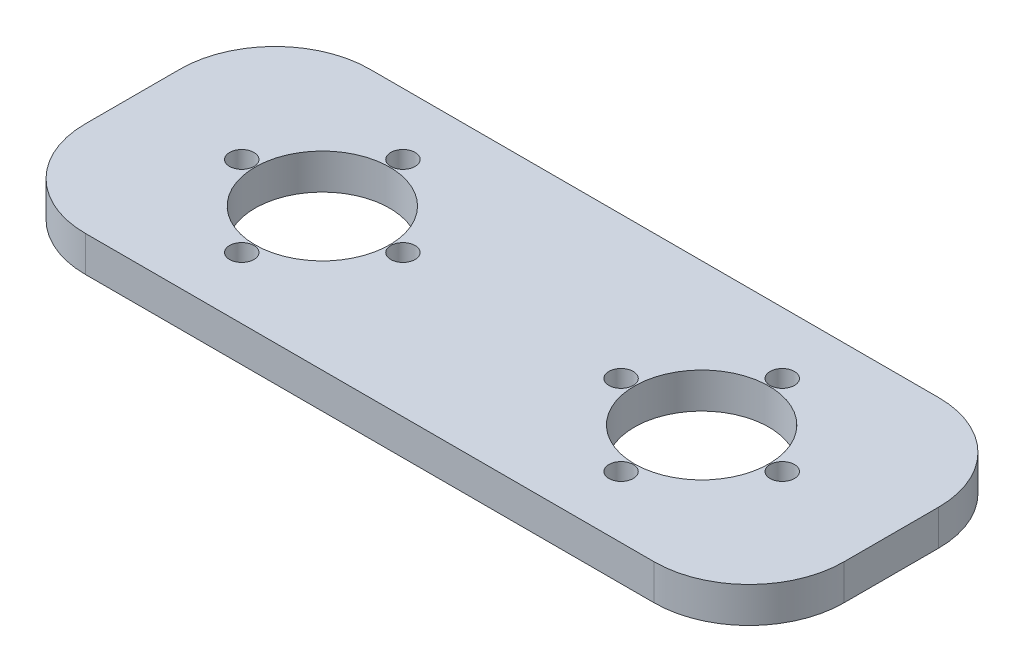
ISO-10303-21;
HEADER;
FILE_DESCRIPTION(('STEP AP214'),'2;1');
FILE_NAME('part.step','',(''),(''),'','','');
FILE_SCHEMA(('AUTOMOTIVE_DESIGN { 1 0 10303 214 1 1 1 1 }'));
ENDSEC;
DATA;
#1=APPLICATION_CONTEXT('core data for automotive mechanical design processes');
#2=APPLICATION_PROTOCOL_DEFINITION('international standard','automotive_design',2000,#1);
#3=PRODUCT_CONTEXT('',#1,'mechanical');
#4=PRODUCT('Part','Part','',(#3));
#5=PRODUCT_RELATED_PRODUCT_CATEGORY('part','',(#4));
#6=PRODUCT_DEFINITION_FORMATION('','',#4);
#7=PRODUCT_DEFINITION_CONTEXT('part definition',#1,'design');
#8=PRODUCT_DEFINITION('design','',#6,#7);
#9=PRODUCT_DEFINITION_SHAPE('','',#8);
#10=(LENGTH_UNIT() NAMED_UNIT(*) SI_UNIT(.MILLI.,.METRE.));
#11=(NAMED_UNIT(*) PLANE_ANGLE_UNIT() SI_UNIT($,.RADIAN.));
#12=(NAMED_UNIT(*) SI_UNIT($,.STERADIAN.) SOLID_ANGLE_UNIT());
#13=UNCERTAINTY_MEASURE_WITH_UNIT(LENGTH_MEASURE(1.E-05),#10,'distance_accuracy_value','');
#14=(GEOMETRIC_REPRESENTATION_CONTEXT(3) GLOBAL_UNCERTAINTY_ASSIGNED_CONTEXT((#13)) GLOBAL_UNIT_ASSIGNED_CONTEXT((#10,
#11,#12)) REPRESENTATION_CONTEXT('',''));
#15=CARTESIAN_POINT('',(0.,0.,0.));
#16=DIRECTION('',(0.,0.,1.));
#17=DIRECTION('',(1.,0.,0.));
#18=AXIS2_PLACEMENT_3D('',#15,#16,#17);
#19=CARTESIAN_POINT('',(0.,4.7625,-38.1));
#20=DIRECTION('',(0.,-1.,0.));
#21=DIRECTION('',(0.,0.,-1.));
#22=AXIS2_PLACEMENT_3D('',#19,#20,#21);
#23=PLANE('',#22);
#24=CARTESIAN_POINT('',(25.4,4.7625,-29.845));
#25=DIRECTION('',(0.,1.,0.));
#26=DIRECTION('',(0.,0.,1.));
#27=AXIS2_PLACEMENT_3D('',#24,#25,#26);
#28=CIRCLE('',#27,1.63194999999999);
#29=CARTESIAN_POINT('',(25.4,4.7625,-28.21305));
#30=VERTEX_POINT('',#29);
#31=EDGE_CURVE('E166',#30,#30,#28,.T.);
#32=ORIENTED_EDGE('',*,*,#31,.F.);
#33=EDGE_LOOP('',(#32));
#34=FACE_BOUND('',#33,.T.);
#35=CARTESIAN_POINT('',(36.195,4.7625,-19.05));
#36=DIRECTION('',(0.,1.,0.));
#37=DIRECTION('',(0.,0.,1.));
#38=AXIS2_PLACEMENT_3D('',#35,#36,#37);
#39=CIRCLE('',#38,1.63194999999999);
#40=CARTESIAN_POINT('',(36.195,4.7625,-17.41805));
#41=VERTEX_POINT('',#40);
#42=EDGE_CURVE('E162',#41,#41,#39,.T.);
#43=ORIENTED_EDGE('',*,*,#42,.F.);
#44=EDGE_LOOP('',(#43));
#45=FACE_BOUND('',#44,.T.);
#46=CARTESIAN_POINT('',(25.4,4.7625,-8.255));
#47=DIRECTION('',(0.,1.,0.));
#48=DIRECTION('',(0.,0.,1.));
#49=AXIS2_PLACEMENT_3D('',#46,#47,#48);
#50=CIRCLE('',#49,1.63194999999999);
#51=CARTESIAN_POINT('',(25.4,4.7625,-6.62305000000001));
#52=VERTEX_POINT('',#51);
#53=EDGE_CURVE('E158',#52,#52,#50,.T.);
#54=ORIENTED_EDGE('',*,*,#53,.F.);
#55=EDGE_LOOP('',(#54));
#56=FACE_BOUND('',#55,.T.);
#57=CARTESIAN_POINT('',(14.605,4.7625,-19.05));
#58=DIRECTION('',(0.,1.,0.));
#59=DIRECTION('',(0.,0.,1.));
#60=AXIS2_PLACEMENT_3D('',#57,#58,#59);
#61=CIRCLE('',#60,1.63194999999999);
#62=CARTESIAN_POINT('',(14.605,4.7625,-17.41805));
#63=VERTEX_POINT('',#62);
#64=EDGE_CURVE('E154',#63,#63,#61,.T.);
#65=ORIENTED_EDGE('',*,*,#64,.F.);
#66=EDGE_LOOP('',(#65));
#67=FACE_BOUND('',#66,.T.);
#68=CARTESIAN_POINT('',(65.405,4.7625,-19.05));
#69=DIRECTION('',(0.,1.,0.));
#70=DIRECTION('',(0.,0.,1.));
#71=AXIS2_PLACEMENT_3D('',#68,#69,#70);
#72=CIRCLE('',#71,1.63194999999999);
#73=CARTESIAN_POINT('',(65.405,4.7625,-17.41805));
#74=VERTEX_POINT('',#73);
#75=EDGE_CURVE('E150',#74,#74,#72,.T.);
#76=ORIENTED_EDGE('',*,*,#75,.F.);
#77=EDGE_LOOP('',(#76));
#78=FACE_BOUND('',#77,.T.);
#79=CARTESIAN_POINT('',(76.2,4.7625,-29.845));
#80=DIRECTION('',(0.,1.,0.));
#81=DIRECTION('',(0.,0.,1.));
#82=AXIS2_PLACEMENT_3D('',#79,#80,#81);
#83=CIRCLE('',#82,1.63194999999999);
#84=CARTESIAN_POINT('',(76.2,4.7625,-28.21305));
#85=VERTEX_POINT('',#84);
#86=EDGE_CURVE('E146',#85,#85,#83,.T.);
#87=ORIENTED_EDGE('',*,*,#86,.F.);
#88=EDGE_LOOP('',(#87));
#89=FACE_BOUND('',#88,.T.);
#90=CARTESIAN_POINT('',(86.995,4.7625,-19.05));
#91=DIRECTION('',(0.,1.,0.));
#92=DIRECTION('',(0.,0.,1.));
#93=AXIS2_PLACEMENT_3D('',#90,#91,#92);
#94=CIRCLE('',#93,1.63194999999999);
#95=CARTESIAN_POINT('',(86.995,4.7625,-17.41805));
#96=VERTEX_POINT('',#95);
#97=EDGE_CURVE('E142',#96,#96,#94,.T.);
#98=ORIENTED_EDGE('',*,*,#97,.F.);
#99=EDGE_LOOP('',(#98));
#100=FACE_BOUND('',#99,.T.);
#101=CARTESIAN_POINT('',(76.2,4.7625,-8.255));
#102=DIRECTION('',(0.,1.,0.));
#103=DIRECTION('',(0.,0.,1.));
#104=AXIS2_PLACEMENT_3D('',#101,#102,#103);
#105=CIRCLE('',#104,1.63194999999999);
#106=CARTESIAN_POINT('',(76.2,4.7625,-6.62305000000001));
#107=VERTEX_POINT('',#106);
#108=EDGE_CURVE('E138',#107,#107,#105,.T.);
#109=ORIENTED_EDGE('',*,*,#108,.F.);
#110=EDGE_LOOP('',(#109));
#111=FACE_BOUND('',#110,.T.);
#112=CARTESIAN_POINT('',(25.4,4.7625,-19.05));
#113=DIRECTION('',(0.,1.,0.));
#114=DIRECTION('',(0.,0.,1.));
#115=AXIS2_PLACEMENT_3D('',#112,#113,#114);
#116=CIRCLE('',#115,9.017);
#117=CARTESIAN_POINT('',(25.4,4.7625,-10.033));
#118=VERTEX_POINT('',#117);
#119=EDGE_CURVE('E196',#118,#118,#116,.T.);
#120=ORIENTED_EDGE('',*,*,#119,.F.);
#121=EDGE_LOOP('',(#120));
#122=FACE_BOUND('',#121,.T.);
#123=DIRECTION('',(0.,0.,-1.));
#124=VECTOR('',#123,1.);
#125=CARTESIAN_POINT('',(101.6,4.7625,0.));
#126=LINE('',#125,#124);
#127=CARTESIAN_POINT('',(101.6,4.7625,-12.7));
#128=VERTEX_POINT('',#127);
#129=CARTESIAN_POINT('',(101.6,4.7625,-25.4));
#130=VERTEX_POINT('',#129);
#131=EDGE_CURVE('E203',#128,#130,#126,.T.);
#132=ORIENTED_EDGE('',*,*,#131,.T.);
#133=CARTESIAN_POINT('',(88.9,4.7625,-25.4));
#134=DIRECTION('',(0.,-1.,0.));
#135=DIRECTION('',(0.,0.,-1.));
#136=AXIS2_PLACEMENT_3D('',#133,#134,#135);
#137=CIRCLE('',#136,12.7);
#138=CARTESIAN_POINT('',(88.9,4.7625,-38.1));
#139=VERTEX_POINT('',#138);
#140=EDGE_CURVE('E180',#130,#139,#137,.F.);
#141=ORIENTED_EDGE('',*,*,#140,.T.);
#142=DIRECTION('',(-1.,0.,0.));
#143=VECTOR('',#142,1.);
#144=CARTESIAN_POINT('',(0.,4.7625,-38.1));
#145=LINE('',#144,#143);
#146=CARTESIAN_POINT('',(12.7,4.7625,-38.1));
#147=VERTEX_POINT('',#146);
#148=EDGE_CURVE('E118',#139,#147,#145,.T.);
#149=ORIENTED_EDGE('',*,*,#148,.T.);
#150=CARTESIAN_POINT('',(12.7,4.7625,-25.4));
#151=DIRECTION('',(0.,-1.,0.));
#152=DIRECTION('',(0.,0.,-1.));
#153=AXIS2_PLACEMENT_3D('',#150,#151,#152);
#154=CIRCLE('',#153,12.7);
#155=CARTESIAN_POINT('',(0.,4.7625,-25.4));
#156=VERTEX_POINT('',#155);
#157=EDGE_CURVE('E175',#147,#156,#154,.F.);
#158=ORIENTED_EDGE('',*,*,#157,.T.);
#159=DIRECTION('',(0.,0.,1.));
#160=VECTOR('',#159,1.);
#161=CARTESIAN_POINT('',(0.,4.7625,0.));
#162=LINE('',#161,#160);
#163=CARTESIAN_POINT('',(0.,4.7625,-12.7));
#164=VERTEX_POINT('',#163);
#165=EDGE_CURVE('E125',#156,#164,#162,.T.);
#166=ORIENTED_EDGE('',*,*,#165,.T.);
#167=CARTESIAN_POINT('',(12.7,4.7625,-12.7));
#168=DIRECTION('',(0.,-1.,0.));
#169=DIRECTION('',(0.,0.,-1.));
#170=AXIS2_PLACEMENT_3D('',#167,#168,#169);
#171=CIRCLE('',#170,12.7);
#172=CARTESIAN_POINT('',(12.7,4.7625,0.));
#173=VERTEX_POINT('',#172);
#174=EDGE_CURVE('E54',#164,#173,#171,.F.);
#175=ORIENTED_EDGE('',*,*,#174,.T.);
#176=DIRECTION('',(1.,0.,0.));
#177=VECTOR('',#176,1.);
#178=CARTESIAN_POINT('',(0.,4.7625,0.));
#179=LINE('',#178,#177);
#180=CARTESIAN_POINT('',(88.9,4.7625,0.));
#181=VERTEX_POINT('',#180);
#182=EDGE_CURVE('E128',#173,#181,#179,.T.);
#183=ORIENTED_EDGE('',*,*,#182,.T.);
#184=CARTESIAN_POINT('',(88.9,4.7625,-12.7));
#185=DIRECTION('',(0.,-1.,0.));
#186=DIRECTION('',(0.,0.,-1.));
#187=AXIS2_PLACEMENT_3D('',#184,#185,#186);
#188=CIRCLE('',#187,12.7);
#189=EDGE_CURVE('E178',#181,#128,#188,.F.);
#190=ORIENTED_EDGE('',*,*,#189,.T.);
#191=EDGE_LOOP('',(#132,#141,#149,#158,#166,#175,#183,#190));
#192=FACE_BOUND('',#191,.T.);
#193=CARTESIAN_POINT('',(76.2,4.7625,-19.05));
#194=DIRECTION('',(0.,1.,0.));
#195=DIRECTION('',(0.,0.,1.));
#196=AXIS2_PLACEMENT_3D('',#193,#194,#195);
#197=CIRCLE('',#196,9.01699999999999);
#198=CARTESIAN_POINT('',(76.2,4.7625,-10.033));
#199=VERTEX_POINT('',#198);
#200=EDGE_CURVE('E208',#199,#199,#197,.T.);
#201=ORIENTED_EDGE('',*,*,#200,.F.);
#202=EDGE_LOOP('',(#201));
#203=FACE_BOUND('',#202,.T.);
#204=ADVANCED_FACE('F32',(#34,#45,#56,#67,#78,#89,#100,#111,#122,#192,#203),#23,.F.);
#205=CARTESIAN_POINT('',(0.,0.,-38.1));
#206=DIRECTION('',(0.,-1.,0.));
#207=DIRECTION('',(0.,0.,-1.));
#208=AXIS2_PLACEMENT_3D('',#205,#206,#207);
#209=PLANE('',#208);
#210=CARTESIAN_POINT('',(25.4,0.,-29.845));
#211=DIRECTION('',(0.,-1.,0.));
#212=DIRECTION('',(0.,0.,-1.));
#213=AXIS2_PLACEMENT_3D('',#210,#211,#212);
#214=CIRCLE('',#213,1.63194999999999);
#215=CARTESIAN_POINT('',(25.4,0.,-31.47695));
#216=VERTEX_POINT('',#215);
#217=EDGE_CURVE('E163',#216,#216,#214,.T.);
#218=ORIENTED_EDGE('',*,*,#217,.F.);
#219=EDGE_LOOP('',(#218));
#220=FACE_BOUND('',#219,.T.);
#221=CARTESIAN_POINT('',(36.195,0.,-19.05));
#222=DIRECTION('',(0.,-1.,0.));
#223=DIRECTION('',(0.,0.,-1.));
#224=AXIS2_PLACEMENT_3D('',#221,#222,#223);
#225=CIRCLE('',#224,1.63194999999999);
#226=CARTESIAN_POINT('',(36.195,0.,-20.68195));
#227=VERTEX_POINT('',#226);
#228=EDGE_CURVE('E159',#227,#227,#225,.T.);
#229=ORIENTED_EDGE('',*,*,#228,.F.);
#230=EDGE_LOOP('',(#229));
#231=FACE_BOUND('',#230,.T.);
#232=CARTESIAN_POINT('',(25.4,0.,-8.255));
#233=DIRECTION('',(0.,-1.,0.));
#234=DIRECTION('',(0.,0.,-1.));
#235=AXIS2_PLACEMENT_3D('',#232,#233,#234);
#236=CIRCLE('',#235,1.63194999999999);
#237=CARTESIAN_POINT('',(25.4,0.,-9.88694999999999));
#238=VERTEX_POINT('',#237);
#239=EDGE_CURVE('E155',#238,#238,#236,.T.);
#240=ORIENTED_EDGE('',*,*,#239,.F.);
#241=EDGE_LOOP('',(#240));
#242=FACE_BOUND('',#241,.T.);
#243=CARTESIAN_POINT('',(14.605,0.,-19.05));
#244=DIRECTION('',(0.,-1.,0.));
#245=DIRECTION('',(0.,0.,-1.));
#246=AXIS2_PLACEMENT_3D('',#243,#244,#245);
#247=CIRCLE('',#246,1.63194999999999);
#248=CARTESIAN_POINT('',(14.605,0.,-20.68195));
#249=VERTEX_POINT('',#248);
#250=EDGE_CURVE('E151',#249,#249,#247,.T.);
#251=ORIENTED_EDGE('',*,*,#250,.F.);
#252=EDGE_LOOP('',(#251));
#253=FACE_BOUND('',#252,.T.);
#254=CARTESIAN_POINT('',(65.405,0.,-19.05));
#255=DIRECTION('',(0.,-1.,0.));
#256=DIRECTION('',(0.,0.,-1.));
#257=AXIS2_PLACEMENT_3D('',#254,#255,#256);
#258=CIRCLE('',#257,1.63194999999999);
#259=CARTESIAN_POINT('',(65.405,0.,-20.68195));
#260=VERTEX_POINT('',#259);
#261=EDGE_CURVE('E147',#260,#260,#258,.T.);
#262=ORIENTED_EDGE('',*,*,#261,.F.);
#263=EDGE_LOOP('',(#262));
#264=FACE_BOUND('',#263,.T.);
#265=CARTESIAN_POINT('',(76.2,0.,-29.845));
#266=DIRECTION('',(0.,-1.,0.));
#267=DIRECTION('',(0.,0.,-1.));
#268=AXIS2_PLACEMENT_3D('',#265,#266,#267);
#269=CIRCLE('',#268,1.63194999999999);
#270=CARTESIAN_POINT('',(76.2,0.,-31.47695));
#271=VERTEX_POINT('',#270);
#272=EDGE_CURVE('E143',#271,#271,#269,.T.);
#273=ORIENTED_EDGE('',*,*,#272,.F.);
#274=EDGE_LOOP('',(#273));
#275=FACE_BOUND('',#274,.T.);
#276=CARTESIAN_POINT('',(86.995,0.,-19.05));
#277=DIRECTION('',(0.,-1.,0.));
#278=DIRECTION('',(0.,0.,-1.));
#279=AXIS2_PLACEMENT_3D('',#276,#277,#278);
#280=CIRCLE('',#279,1.63194999999999);
#281=CARTESIAN_POINT('',(86.995,0.,-20.68195));
#282=VERTEX_POINT('',#281);
#283=EDGE_CURVE('E139',#282,#282,#280,.T.);
#284=ORIENTED_EDGE('',*,*,#283,.F.);
#285=EDGE_LOOP('',(#284));
#286=FACE_BOUND('',#285,.T.);
#287=CARTESIAN_POINT('',(76.2,0.,-8.255));
#288=DIRECTION('',(0.,-1.,0.));
#289=DIRECTION('',(0.,0.,-1.));
#290=AXIS2_PLACEMENT_3D('',#287,#288,#289);
#291=CIRCLE('',#290,1.63194999999999);
#292=CARTESIAN_POINT('',(76.2,0.,-9.88695));
#293=VERTEX_POINT('',#292);
#294=EDGE_CURVE('E134',#293,#293,#291,.T.);
#295=ORIENTED_EDGE('',*,*,#294,.F.);
#296=EDGE_LOOP('',(#295));
#297=FACE_BOUND('',#296,.T.);
#298=CARTESIAN_POINT('',(25.4,0.,-19.05));
#299=DIRECTION('',(0.,1.,0.));
#300=DIRECTION('',(0.,0.,1.));
#301=AXIS2_PLACEMENT_3D('',#298,#299,#300);
#302=CIRCLE('',#301,9.017);
#303=CARTESIAN_POINT('',(25.4,0.,-10.033));
#304=VERTEX_POINT('',#303);
#305=EDGE_CURVE('E199',#304,#304,#302,.T.);
#306=ORIENTED_EDGE('',*,*,#305,.T.);
#307=EDGE_LOOP('',(#306));
#308=FACE_BOUND('',#307,.T.);
#309=DIRECTION('',(-1.,0.,0.));
#310=VECTOR('',#309,1.);
#311=CARTESIAN_POINT('',(0.,0.,-38.1));
#312=LINE('',#311,#310);
#313=CARTESIAN_POINT('',(88.9,0.,-38.1));
#314=VERTEX_POINT('',#313);
#315=CARTESIAN_POINT('',(12.7,0.,-38.1));
#316=VERTEX_POINT('',#315);
#317=EDGE_CURVE('E115',#314,#316,#312,.T.);
#318=ORIENTED_EDGE('',*,*,#317,.F.);
#319=CARTESIAN_POINT('',(88.9,0.,-25.4));
#320=DIRECTION('',(0.,-1.,0.));
#321=DIRECTION('',(0.,0.,-1.));
#322=AXIS2_PLACEMENT_3D('',#319,#320,#321);
#323=CIRCLE('',#322,12.7);
#324=CARTESIAN_POINT('',(101.6,0.,-25.4));
#325=VERTEX_POINT('',#324);
#326=EDGE_CURVE('E98',#314,#325,#323,.T.);
#327=ORIENTED_EDGE('',*,*,#326,.T.);
#328=DIRECTION('',(0.,0.,-1.));
#329=VECTOR('',#328,1.);
#330=CARTESIAN_POINT('',(101.6,0.,0.));
#331=LINE('',#330,#329);
#332=CARTESIAN_POINT('',(101.6,0.,-12.7));
#333=VERTEX_POINT('',#332);
#334=EDGE_CURVE('E126',#333,#325,#331,.T.);
#335=ORIENTED_EDGE('',*,*,#334,.F.);
#336=CARTESIAN_POINT('',(88.9,0.,-12.7));
#337=DIRECTION('',(0.,-1.,0.));
#338=DIRECTION('',(0.,0.,-1.));
#339=AXIS2_PLACEMENT_3D('',#336,#337,#338);
#340=CIRCLE('',#339,12.7);
#341=CARTESIAN_POINT('',(88.9,0.,0.));
#342=VERTEX_POINT('',#341);
#343=EDGE_CURVE('E109',#333,#342,#340,.T.);
#344=ORIENTED_EDGE('',*,*,#343,.T.);
#345=DIRECTION('',(1.,0.,0.));
#346=VECTOR('',#345,1.);
#347=CARTESIAN_POINT('',(0.,0.,0.));
#348=LINE('',#347,#346);
#349=CARTESIAN_POINT('',(12.7,0.,0.));
#350=VERTEX_POINT('',#349);
#351=EDGE_CURVE('E130',#350,#342,#348,.T.);
#352=ORIENTED_EDGE('',*,*,#351,.F.);
#353=CARTESIAN_POINT('',(12.7,0.,-12.7));
#354=DIRECTION('',(0.,-1.,0.));
#355=DIRECTION('',(0.,0.,-1.));
#356=AXIS2_PLACEMENT_3D('',#353,#354,#355);
#357=CIRCLE('',#356,12.7);
#358=CARTESIAN_POINT('',(0.,0.,-12.7));
#359=VERTEX_POINT('',#358);
#360=EDGE_CURVE('E169',#350,#359,#357,.T.);
#361=ORIENTED_EDGE('',*,*,#360,.T.);
#362=DIRECTION('',(0.,0.,1.));
#363=VECTOR('',#362,1.);
#364=CARTESIAN_POINT('',(0.,0.,0.));
#365=LINE('',#364,#363);
#366=CARTESIAN_POINT('',(0.,0.,-25.4));
#367=VERTEX_POINT('',#366);
#368=EDGE_CURVE('E191',#367,#359,#365,.T.);
#369=ORIENTED_EDGE('',*,*,#368,.F.);
#370=CARTESIAN_POINT('',(12.7,0.,-25.4));
#371=DIRECTION('',(0.,-1.,0.));
#372=DIRECTION('',(0.,0.,-1.));
#373=AXIS2_PLACEMENT_3D('',#370,#371,#372);
#374=CIRCLE('',#373,12.7);
#375=EDGE_CURVE('E119',#367,#316,#374,.T.);
#376=ORIENTED_EDGE('',*,*,#375,.T.);
#377=EDGE_LOOP('',(#318,#327,#335,#344,#352,#361,#369,#376));
#378=FACE_BOUND('',#377,.T.);
#379=CARTESIAN_POINT('',(76.2,0.,-19.05));
#380=DIRECTION('',(0.,1.,0.));
#381=DIRECTION('',(0.,0.,1.));
#382=AXIS2_PLACEMENT_3D('',#379,#380,#381);
#383=CIRCLE('',#382,9.01699999999999);
#384=CARTESIAN_POINT('',(76.2,0.,-10.033));
#385=VERTEX_POINT('',#384);
#386=EDGE_CURVE('E137',#385,#385,#383,.T.);
#387=ORIENTED_EDGE('',*,*,#386,.T.);
#388=EDGE_LOOP('',(#387));
#389=FACE_BOUND('',#388,.T.);
#390=ADVANCED_FACE('F122',(#220,#231,#242,#253,#264,#275,#286,#297,#308,#378,#389),#209,.T.);
#391=CARTESIAN_POINT('',(0.,4.7625,0.));
#392=DIRECTION('',(1.,0.,0.));
#393=DIRECTION('',(0.,0.,-1.));
#394=AXIS2_PLACEMENT_3D('',#391,#392,#393);
#395=PLANE('',#394);
#396=ORIENTED_EDGE('',*,*,#368,.T.);
#397=DIRECTION('',(0.,-1.,0.));
#398=VECTOR('',#397,1.);
#399=CARTESIAN_POINT('',(0.,4.7625,-12.7));
#400=LINE('',#399,#398);
#401=EDGE_CURVE('E11',#359,#164,#400,.F.);
#402=ORIENTED_EDGE('',*,*,#401,.T.);
#403=ORIENTED_EDGE('',*,*,#165,.F.);
#404=DIRECTION('',(0.,-1.,0.));
#405=VECTOR('',#404,1.);
#406=CARTESIAN_POINT('',(0.,4.7625,-25.4));
#407=LINE('',#406,#405);
#408=EDGE_CURVE('E40',#156,#367,#407,.T.);
#409=ORIENTED_EDGE('',*,*,#408,.T.);
#410=EDGE_LOOP('',(#396,#402,#403,#409));
#411=FACE_BOUND('',#410,.T.);
#412=ADVANCED_FACE('F190',(#411),#395,.F.);
#413=CARTESIAN_POINT('',(0.,4.7625,0.));
#414=DIRECTION('',(0.,0.,-1.));
#415=DIRECTION('',(-1.,0.,0.));
#416=AXIS2_PLACEMENT_3D('',#413,#414,#415);
#417=PLANE('',#416);
#418=ORIENTED_EDGE('',*,*,#351,.T.);
#419=DIRECTION('',(0.,-1.,0.));
#420=VECTOR('',#419,1.);
#421=CARTESIAN_POINT('',(88.9,4.7625,0.));
#422=LINE('',#421,#420);
#423=EDGE_CURVE('E47',#342,#181,#422,.F.);
#424=ORIENTED_EDGE('',*,*,#423,.T.);
#425=ORIENTED_EDGE('',*,*,#182,.F.);
#426=DIRECTION('',(0.,-1.,0.));
#427=VECTOR('',#426,1.);
#428=CARTESIAN_POINT('',(12.7,4.7625,0.));
#429=LINE('',#428,#427);
#430=EDGE_CURVE('E182',#173,#350,#429,.T.);
#431=ORIENTED_EDGE('',*,*,#430,.T.);
#432=EDGE_LOOP('',(#418,#424,#425,#431));
#433=FACE_BOUND('',#432,.T.);
#434=ADVANCED_FACE('F268',(#433),#417,.F.);
#435=CARTESIAN_POINT('',(101.6,4.7625,0.));
#436=DIRECTION('',(-1.,0.,0.));
#437=DIRECTION('',(0.,0.,1.));
#438=AXIS2_PLACEMENT_3D('',#435,#436,#437);
#439=PLANE('',#438);
#440=ORIENTED_EDGE('',*,*,#334,.T.);
#441=DIRECTION('',(0.,-1.,0.));
#442=VECTOR('',#441,1.);
#443=CARTESIAN_POINT('',(101.6,4.7625,-25.4));
#444=LINE('',#443,#442);
#445=EDGE_CURVE('E103',#325,#130,#444,.F.);
#446=ORIENTED_EDGE('',*,*,#445,.T.);
#447=ORIENTED_EDGE('',*,*,#131,.F.);
#448=DIRECTION('',(0.,-1.,0.));
#449=VECTOR('',#448,1.);
#450=CARTESIAN_POINT('',(101.6,4.7625,-12.7));
#451=LINE('',#450,#449);
#452=EDGE_CURVE('E108',#128,#333,#451,.T.);
#453=ORIENTED_EDGE('',*,*,#452,.T.);
#454=EDGE_LOOP('',(#440,#446,#447,#453));
#455=FACE_BOUND('',#454,.T.);
#456=ADVANCED_FACE('F276',(#455),#439,.F.);
#457=CARTESIAN_POINT('',(0.,4.7625,-38.1));
#458=DIRECTION('',(0.,0.,1.));
#459=DIRECTION('',(1.,0.,0.));
#460=AXIS2_PLACEMENT_3D('',#457,#458,#459);
#461=PLANE('',#460);
#462=ORIENTED_EDGE('',*,*,#148,.F.);
#463=DIRECTION('',(0.,-1.,0.));
#464=VECTOR('',#463,1.);
#465=CARTESIAN_POINT('',(88.9,4.7625,-38.1));
#466=LINE('',#465,#464);
#467=EDGE_CURVE('E102',#139,#314,#466,.T.);
#468=ORIENTED_EDGE('',*,*,#467,.T.);
#469=ORIENTED_EDGE('',*,*,#317,.T.);
#470=DIRECTION('',(0.,-1.,0.));
#471=VECTOR('',#470,1.);
#472=CARTESIAN_POINT('',(12.7,4.7625,-38.1));
#473=LINE('',#472,#471);
#474=EDGE_CURVE('E120',#316,#147,#473,.F.);
#475=ORIENTED_EDGE('',*,*,#474,.T.);
#476=EDGE_LOOP('',(#462,#468,#469,#475));
#477=FACE_BOUND('',#476,.T.);
#478=ADVANCED_FACE('F114',(#477),#461,.F.);
#479=CARTESIAN_POINT('',(25.4,4.7625,-19.05));
#480=DIRECTION('',(0.,-1.,0.));
#481=DIRECTION('',(0.,0.,-1.));
#482=AXIS2_PLACEMENT_3D('',#479,#480,#481);
#483=CYLINDRICAL_SURFACE('',#482,9.017);
#484=ORIENTED_EDGE('',*,*,#119,.T.);
#485=EDGE_LOOP('',(#484));
#486=FACE_BOUND('',#485,.T.);
#487=ORIENTED_EDGE('',*,*,#305,.F.);
#488=EDGE_LOOP('',(#487));
#489=FACE_BOUND('',#488,.T.);
#490=ADVANCED_FACE('F259',(#486,#489),#483,.F.);
#491=CARTESIAN_POINT('',(76.2,4.7625,-19.05));
#492=DIRECTION('',(0.,-1.,0.));
#493=DIRECTION('',(0.,0.,-1.));
#494=AXIS2_PLACEMENT_3D('',#491,#492,#493);
#495=CYLINDRICAL_SURFACE('',#494,9.01699999999999);
#496=ORIENTED_EDGE('',*,*,#200,.T.);
#497=EDGE_LOOP('',(#496));
#498=FACE_BOUND('',#497,.T.);
#499=ORIENTED_EDGE('',*,*,#386,.F.);
#500=EDGE_LOOP('',(#499));
#501=FACE_BOUND('',#500,.T.);
#502=ADVANCED_FACE('F255',(#498,#501),#495,.F.);
#503=CARTESIAN_POINT('',(76.2,4.7625,-8.255));
#504=DIRECTION('',(0.,1.,0.));
#505=DIRECTION('',(0.,0.,1.));
#506=AXIS2_PLACEMENT_3D('',#503,#504,#505);
#507=CYLINDRICAL_SURFACE('',#506,1.63194999999999);
#508=ORIENTED_EDGE('',*,*,#294,.T.);
#509=EDGE_LOOP('',(#508));
#510=FACE_BOUND('',#509,.T.);
#511=ORIENTED_EDGE('',*,*,#108,.T.);
#512=EDGE_LOOP('',(#511));
#513=FACE_BOUND('',#512,.T.);
#514=ADVANCED_FACE('F258',(#510,#513),#507,.F.);
#515=CARTESIAN_POINT('',(86.995,4.7625,-19.05));
#516=DIRECTION('',(0.,1.,0.));
#517=DIRECTION('',(0.,0.,1.));
#518=AXIS2_PLACEMENT_3D('',#515,#516,#517);
#519=CYLINDRICAL_SURFACE('',#518,1.63194999999999);
#520=ORIENTED_EDGE('',*,*,#283,.T.);
#521=EDGE_LOOP('',(#520));
#522=FACE_BOUND('',#521,.T.);
#523=ORIENTED_EDGE('',*,*,#97,.T.);
#524=EDGE_LOOP('',(#523));
#525=FACE_BOUND('',#524,.T.);
#526=ADVANCED_FACE('F409',(#522,#525),#519,.F.);
#527=CARTESIAN_POINT('',(76.2,4.7625,-29.845));
#528=DIRECTION('',(0.,1.,0.));
#529=DIRECTION('',(0.,0.,1.));
#530=AXIS2_PLACEMENT_3D('',#527,#528,#529);
#531=CYLINDRICAL_SURFACE('',#530,1.63194999999999);
#532=ORIENTED_EDGE('',*,*,#272,.T.);
#533=EDGE_LOOP('',(#532));
#534=FACE_BOUND('',#533,.T.);
#535=ORIENTED_EDGE('',*,*,#86,.T.);
#536=EDGE_LOOP('',(#535));
#537=FACE_BOUND('',#536,.T.);
#538=ADVANCED_FACE('F399',(#534,#537),#531,.F.);
#539=CARTESIAN_POINT('',(65.405,4.7625,-19.05));
#540=DIRECTION('',(0.,1.,0.));
#541=DIRECTION('',(0.,0.,1.));
#542=AXIS2_PLACEMENT_3D('',#539,#540,#541);
#543=CYLINDRICAL_SURFACE('',#542,1.63194999999999);
#544=ORIENTED_EDGE('',*,*,#261,.T.);
#545=EDGE_LOOP('',(#544));
#546=FACE_BOUND('',#545,.T.);
#547=ORIENTED_EDGE('',*,*,#75,.T.);
#548=EDGE_LOOP('',(#547));
#549=FACE_BOUND('',#548,.T.);
#550=ADVANCED_FACE('F389',(#546,#549),#543,.F.);
#551=CARTESIAN_POINT('',(14.605,4.7625,-19.05));
#552=DIRECTION('',(0.,1.,0.));
#553=DIRECTION('',(0.,0.,1.));
#554=AXIS2_PLACEMENT_3D('',#551,#552,#553);
#555=CYLINDRICAL_SURFACE('',#554,1.63194999999999);
#556=ORIENTED_EDGE('',*,*,#250,.T.);
#557=EDGE_LOOP('',(#556));
#558=FACE_BOUND('',#557,.T.);
#559=ORIENTED_EDGE('',*,*,#64,.T.);
#560=EDGE_LOOP('',(#559));
#561=FACE_BOUND('',#560,.T.);
#562=ADVANCED_FACE('F379',(#558,#561),#555,.F.);
#563=CARTESIAN_POINT('',(25.4,4.7625,-8.255));
#564=DIRECTION('',(0.,1.,0.));
#565=DIRECTION('',(0.,0.,1.));
#566=AXIS2_PLACEMENT_3D('',#563,#564,#565);
#567=CYLINDRICAL_SURFACE('',#566,1.63194999999999);
#568=ORIENTED_EDGE('',*,*,#239,.T.);
#569=EDGE_LOOP('',(#568));
#570=FACE_BOUND('',#569,.T.);
#571=ORIENTED_EDGE('',*,*,#53,.T.);
#572=EDGE_LOOP('',(#571));
#573=FACE_BOUND('',#572,.T.);
#574=ADVANCED_FACE('F369',(#570,#573),#567,.F.);
#575=CARTESIAN_POINT('',(36.195,4.7625,-19.05));
#576=DIRECTION('',(0.,1.,0.));
#577=DIRECTION('',(0.,0.,1.));
#578=AXIS2_PLACEMENT_3D('',#575,#576,#577);
#579=CYLINDRICAL_SURFACE('',#578,1.63194999999999);
#580=ORIENTED_EDGE('',*,*,#228,.T.);
#581=EDGE_LOOP('',(#580));
#582=FACE_BOUND('',#581,.T.);
#583=ORIENTED_EDGE('',*,*,#42,.T.);
#584=EDGE_LOOP('',(#583));
#585=FACE_BOUND('',#584,.T.);
#586=ADVANCED_FACE('F359',(#582,#585),#579,.F.);
#587=CARTESIAN_POINT('',(25.4,4.7625,-29.845));
#588=DIRECTION('',(0.,1.,0.));
#589=DIRECTION('',(0.,0.,1.));
#590=AXIS2_PLACEMENT_3D('',#587,#588,#589);
#591=CYLINDRICAL_SURFACE('',#590,1.63194999999999);
#592=ORIENTED_EDGE('',*,*,#217,.T.);
#593=EDGE_LOOP('',(#592));
#594=FACE_BOUND('',#593,.T.);
#595=ORIENTED_EDGE('',*,*,#31,.T.);
#596=EDGE_LOOP('',(#595));
#597=FACE_BOUND('',#596,.T.);
#598=ADVANCED_FACE('F231',(#594,#597),#591,.F.);
#599=CARTESIAN_POINT('',(88.9,4.7625,-25.4));
#600=DIRECTION('',(0.,-1.,0.));
#601=DIRECTION('',(0.,0.,-1.));
#602=AXIS2_PLACEMENT_3D('',#599,#600,#601);
#603=CYLINDRICAL_SURFACE('',#602,12.7);
#604=ORIENTED_EDGE('',*,*,#140,.F.);
#605=ORIENTED_EDGE('',*,*,#445,.F.);
#606=ORIENTED_EDGE('',*,*,#326,.F.);
#607=ORIENTED_EDGE('',*,*,#467,.F.);
#608=EDGE_LOOP('',(#604,#605,#606,#607));
#609=FACE_BOUND('',#608,.T.);
#610=ADVANCED_FACE('F101',(#609),#603,.T.);
#611=CARTESIAN_POINT('',(88.9,4.7625,-12.7));
#612=DIRECTION('',(0.,-1.,0.));
#613=DIRECTION('',(0.,0.,-1.));
#614=AXIS2_PLACEMENT_3D('',#611,#612,#613);
#615=CYLINDRICAL_SURFACE('',#614,12.7);
#616=ORIENTED_EDGE('',*,*,#189,.F.);
#617=ORIENTED_EDGE('',*,*,#423,.F.);
#618=ORIENTED_EDGE('',*,*,#343,.F.);
#619=ORIENTED_EDGE('',*,*,#452,.F.);
#620=EDGE_LOOP('',(#616,#617,#618,#619));
#621=FACE_BOUND('',#620,.T.);
#622=ADVANCED_FACE('F284',(#621),#615,.T.);
#623=CARTESIAN_POINT('',(12.7,4.7625,-12.7));
#624=DIRECTION('',(0.,-1.,0.));
#625=DIRECTION('',(0.,0.,-1.));
#626=AXIS2_PLACEMENT_3D('',#623,#624,#625);
#627=CYLINDRICAL_SURFACE('',#626,12.7);
#628=ORIENTED_EDGE('',*,*,#174,.F.);
#629=ORIENTED_EDGE('',*,*,#401,.F.);
#630=ORIENTED_EDGE('',*,*,#360,.F.);
#631=ORIENTED_EDGE('',*,*,#430,.F.);
#632=EDGE_LOOP('',(#628,#629,#630,#631));
#633=FACE_BOUND('',#632,.T.);
#634=ADVANCED_FACE('F286',(#633),#627,.T.);
#635=CARTESIAN_POINT('',(12.7,4.7625,-25.4));
#636=DIRECTION('',(0.,-1.,0.));
#637=DIRECTION('',(0.,0.,-1.));
#638=AXIS2_PLACEMENT_3D('',#635,#636,#637);
#639=CYLINDRICAL_SURFACE('',#638,12.7);
#640=ORIENTED_EDGE('',*,*,#157,.F.);
#641=ORIENTED_EDGE('',*,*,#474,.F.);
#642=ORIENTED_EDGE('',*,*,#375,.F.);
#643=ORIENTED_EDGE('',*,*,#408,.F.);
#644=EDGE_LOOP('',(#640,#641,#642,#643));
#645=FACE_BOUND('',#644,.T.);
#646=ADVANCED_FACE('F34',(#645),#639,.T.);
#647=CLOSED_SHELL('',(#204,#390,#412,#434,#456,#478,#490,#502,#514,#526,#538,#550,#562,#574,
#586,#598,#610,#622,#634,#646));
#648=MANIFOLD_SOLID_BREP('B2',#647);
#649=ADVANCED_BREP_SHAPE_REPRESENTATION('',(#18,#648),#14);
#650=SHAPE_DEFINITION_REPRESENTATION(#9,#649);
ENDSEC;
END-ISO-10303-21;
